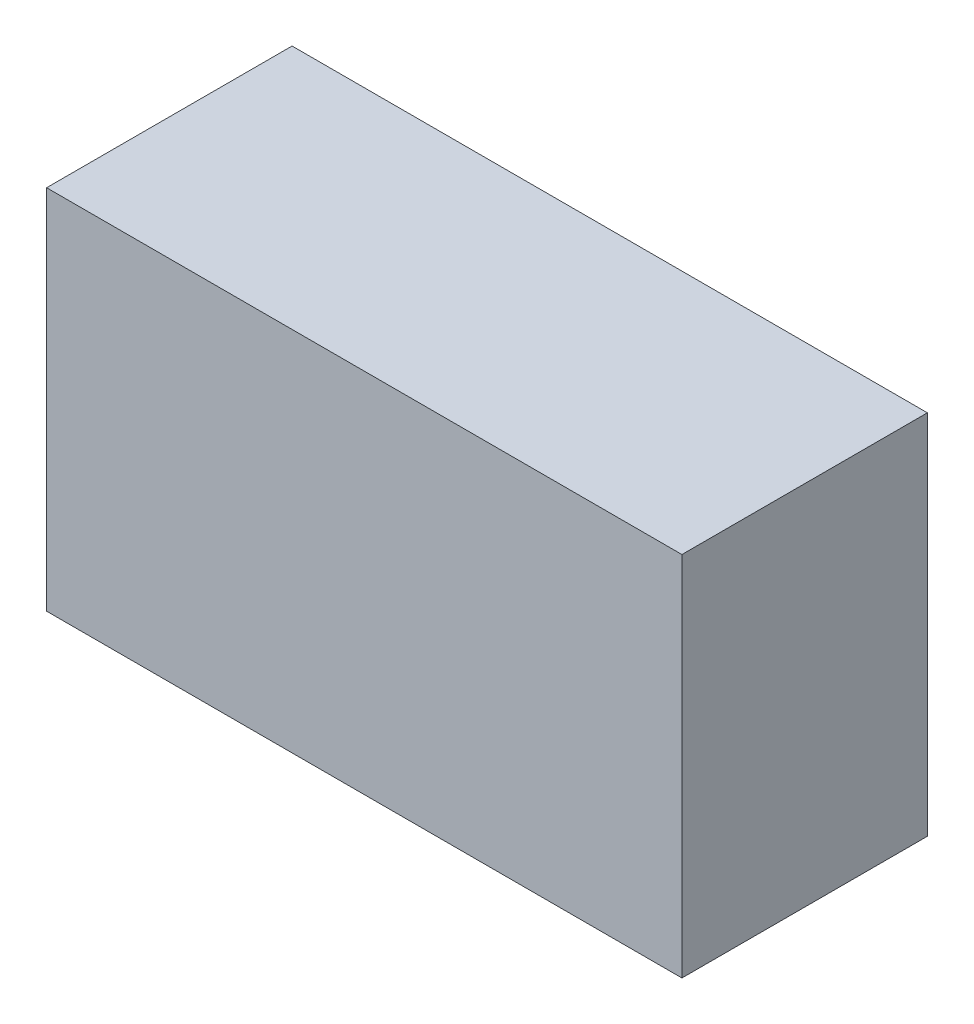
ISO-10303-21;
HEADER;
FILE_DESCRIPTION(('STEP AP214'),'2;1');
FILE_NAME('part.step','',(''),(''),'','','');
FILE_SCHEMA(('AUTOMOTIVE_DESIGN { 1 0 10303 214 1 1 1 1 }'));
ENDSEC;
DATA;
#1=APPLICATION_CONTEXT('core data for automotive mechanical design processes');
#2=APPLICATION_PROTOCOL_DEFINITION('international standard','automotive_design',2000,#1);
#3=PRODUCT_CONTEXT('',#1,'mechanical');
#4=PRODUCT('Part','Part','',(#3));
#5=PRODUCT_RELATED_PRODUCT_CATEGORY('part','',(#4));
#6=PRODUCT_DEFINITION_FORMATION('','',#4);
#7=PRODUCT_DEFINITION_CONTEXT('part definition',#1,'design');
#8=PRODUCT_DEFINITION('design','',#6,#7);
#9=PRODUCT_DEFINITION_SHAPE('','',#8);
#10=(LENGTH_UNIT() NAMED_UNIT(*) SI_UNIT(.MILLI.,.METRE.));
#11=(NAMED_UNIT(*) PLANE_ANGLE_UNIT() SI_UNIT($,.RADIAN.));
#12=(NAMED_UNIT(*) SI_UNIT($,.STERADIAN.) SOLID_ANGLE_UNIT());
#13=UNCERTAINTY_MEASURE_WITH_UNIT(LENGTH_MEASURE(1.E-05),#10,'distance_accuracy_value','');
#14=(GEOMETRIC_REPRESENTATION_CONTEXT(3) GLOBAL_UNCERTAINTY_ASSIGNED_CONTEXT((#13)) GLOBAL_UNIT_ASSIGNED_CONTEXT((#10,
#11,#12)) REPRESENTATION_CONTEXT('',''));
#15=CARTESIAN_POINT('',(0.,0.,0.));
#16=DIRECTION('',(0.,0.,1.));
#17=DIRECTION('',(1.,0.,0.));
#18=AXIS2_PLACEMENT_3D('',#15,#16,#17);
#19=CARTESIAN_POINT('',(-1.10000034,-0.635,0.85000084));
#20=DIRECTION('',(0.,0.,1.));
#21=DIRECTION('',(1.,0.,0.));
#22=AXIS2_PLACEMENT_3D('',#19,#20,#21);
#23=PLANE('',#22);
#24=DIRECTION('',(1.,0.,0.));
#25=VECTOR('',#24,1.);
#26=CARTESIAN_POINT('',(-1.10000034,0.635,0.85000084));
#27=LINE('',#26,#25);
#28=CARTESIAN_POINT('',(-1.10000034,0.635,0.85000084));
#29=VERTEX_POINT('',#28);
#30=CARTESIAN_POINT('',(1.10000034,0.635,0.85000084));
#31=VERTEX_POINT('',#30);
#32=EDGE_CURVE('E53',#29,#31,#27,.T.);
#33=ORIENTED_EDGE('',*,*,#32,.F.);
#34=DIRECTION('',(0.,1.,0.));
#35=VECTOR('',#34,1.);
#36=CARTESIAN_POINT('',(-1.10000034,-0.635,0.85000084));
#37=LINE('',#36,#35);
#38=CARTESIAN_POINT('',(-1.10000034,-0.635,0.85000084));
#39=VERTEX_POINT('',#38);
#40=EDGE_CURVE('E20',#29,#39,#37,.F.);
#41=ORIENTED_EDGE('',*,*,#40,.T.);
#42=DIRECTION('',(1.,0.,0.));
#43=VECTOR('',#42,1.);
#44=CARTESIAN_POINT('',(1.10000034,-0.635,0.85000084));
#45=LINE('',#44,#43);
#46=CARTESIAN_POINT('',(1.10000034,-0.635,0.85000084));
#47=VERTEX_POINT('',#46);
#48=EDGE_CURVE('E67',#47,#39,#45,.F.);
#49=ORIENTED_EDGE('',*,*,#48,.F.);
#50=DIRECTION('',(0.,1.,0.));
#51=VECTOR('',#50,1.);
#52=CARTESIAN_POINT('',(1.10000034,0.635,0.85000084));
#53=LINE('',#52,#51);
#54=EDGE_CURVE('E58',#31,#47,#53,.F.);
#55=ORIENTED_EDGE('',*,*,#54,.F.);
#56=EDGE_LOOP('',(#33,#41,#49,#55));
#57=FACE_BOUND('',#56,.T.);
#58=ADVANCED_FACE('F17',(#57),#23,.T.);
#59=CARTESIAN_POINT('',(1.10000034,-0.635,0.));
#60=DIRECTION('',(0.,-1.,0.));
#61=DIRECTION('',(0.,0.,-1.));
#62=AXIS2_PLACEMENT_3D('',#59,#60,#61);
#63=PLANE('',#62);
#64=DIRECTION('',(0.,0.,1.));
#65=VECTOR('',#64,1.);
#66=CARTESIAN_POINT('',(-1.10000034,-0.635,0.));
#67=LINE('',#66,#65);
#68=CARTESIAN_POINT('',(-1.10000034,-0.635,0.));
#69=VERTEX_POINT('',#68);
#70=EDGE_CURVE('E80',#69,#39,#67,.T.);
#71=ORIENTED_EDGE('',*,*,#70,.F.);
#72=DIRECTION('',(1.,0.,0.));
#73=VECTOR('',#72,1.);
#74=CARTESIAN_POINT('',(-1.10000034,-0.635,0.));
#75=LINE('',#74,#73);
#76=CARTESIAN_POINT('',(1.10000034,-0.635,0.));
#77=VERTEX_POINT('',#76);
#78=EDGE_CURVE('E75',#69,#77,#75,.T.);
#79=ORIENTED_EDGE('',*,*,#78,.T.);
#80=DIRECTION('',(0.,0.,-1.));
#81=VECTOR('',#80,1.);
#82=CARTESIAN_POINT('',(1.10000034,-0.635,0.));
#83=LINE('',#82,#81);
#84=EDGE_CURVE('E63',#47,#77,#83,.T.);
#85=ORIENTED_EDGE('',*,*,#84,.F.);
#86=ORIENTED_EDGE('',*,*,#48,.T.);
#87=EDGE_LOOP('',(#71,#79,#85,#86));
#88=FACE_BOUND('',#87,.T.);
#89=ADVANCED_FACE('F74',(#88),#63,.T.);
#90=CARTESIAN_POINT('',(1.10000034,0.635,0.));
#91=DIRECTION('',(1.,0.,0.));
#92=DIRECTION('',(0.,0.,-1.));
#93=AXIS2_PLACEMENT_3D('',#90,#91,#92);
#94=PLANE('',#93);
#95=ORIENTED_EDGE('',*,*,#84,.T.);
#96=DIRECTION('',(0.,1.,0.));
#97=VECTOR('',#96,1.);
#98=CARTESIAN_POINT('',(1.10000034,-0.635,0.));
#99=LINE('',#98,#97);
#100=CARTESIAN_POINT('',(1.10000034,0.635,0.));
#101=VERTEX_POINT('',#100);
#102=EDGE_CURVE('E84',#77,#101,#99,.T.);
#103=ORIENTED_EDGE('',*,*,#102,.T.);
#104=DIRECTION('',(0.,0.,1.));
#105=VECTOR('',#104,1.);
#106=CARTESIAN_POINT('',(1.10000034,0.635,0.));
#107=LINE('',#106,#105);
#108=EDGE_CURVE('E65',#31,#101,#107,.F.);
#109=ORIENTED_EDGE('',*,*,#108,.F.);
#110=ORIENTED_EDGE('',*,*,#54,.T.);
#111=EDGE_LOOP('',(#95,#103,#109,#110));
#112=FACE_BOUND('',#111,.T.);
#113=ADVANCED_FACE('F60',(#112),#94,.T.);
#114=CARTESIAN_POINT('',(-1.10000034,0.635,0.));
#115=DIRECTION('',(0.,1.,0.));
#116=DIRECTION('',(0.,0.,1.));
#117=AXIS2_PLACEMENT_3D('',#114,#115,#116);
#118=PLANE('',#117);
#119=ORIENTED_EDGE('',*,*,#108,.T.);
#120=DIRECTION('',(1.,0.,0.));
#121=VECTOR('',#120,1.);
#122=CARTESIAN_POINT('',(-1.10000034,0.635,0.));
#123=LINE('',#122,#121);
#124=CARTESIAN_POINT('',(-1.10000034,0.635,0.));
#125=VERTEX_POINT('',#124);
#126=EDGE_CURVE('E26',#101,#125,#123,.F.);
#127=ORIENTED_EDGE('',*,*,#126,.T.);
#128=DIRECTION('',(0.,0.,1.));
#129=VECTOR('',#128,1.);
#130=CARTESIAN_POINT('',(-1.10000034,0.635,0.));
#131=LINE('',#130,#129);
#132=EDGE_CURVE('E34',#29,#125,#131,.F.);
#133=ORIENTED_EDGE('',*,*,#132,.F.);
#134=ORIENTED_EDGE('',*,*,#32,.T.);
#135=EDGE_LOOP('',(#119,#127,#133,#134));
#136=FACE_BOUND('',#135,.T.);
#137=ADVANCED_FACE('F88',(#136),#118,.T.);
#138=CARTESIAN_POINT('',(-1.10000034,-0.635,0.));
#139=DIRECTION('',(-1.,0.,0.));
#140=DIRECTION('',(0.,0.,1.));
#141=AXIS2_PLACEMENT_3D('',#138,#139,#140);
#142=PLANE('',#141);
#143=ORIENTED_EDGE('',*,*,#132,.T.);
#144=DIRECTION('',(0.,1.,0.));
#145=VECTOR('',#144,1.);
#146=CARTESIAN_POINT('',(-1.10000034,-0.635,0.));
#147=LINE('',#146,#145);
#148=EDGE_CURVE('E11',#125,#69,#147,.F.);
#149=ORIENTED_EDGE('',*,*,#148,.T.);
#150=ORIENTED_EDGE('',*,*,#70,.T.);
#151=ORIENTED_EDGE('',*,*,#40,.F.);
#152=EDGE_LOOP('',(#143,#149,#150,#151));
#153=FACE_BOUND('',#152,.T.);
#154=ADVANCED_FACE('F91',(#153),#142,.T.);
#155=CARTESIAN_POINT('',(-1.10000034,-0.635,0.));
#156=DIRECTION('',(0.,0.,1.));
#157=DIRECTION('',(1.,0.,0.));
#158=AXIS2_PLACEMENT_3D('',#155,#156,#157);
#159=PLANE('',#158);
#160=ORIENTED_EDGE('',*,*,#126,.F.);
#161=ORIENTED_EDGE('',*,*,#102,.F.);
#162=ORIENTED_EDGE('',*,*,#78,.F.);
#163=ORIENTED_EDGE('',*,*,#148,.F.);
#164=EDGE_LOOP('',(#160,#161,#162,#163));
#165=FACE_BOUND('',#164,.T.);
#166=ADVANCED_FACE('F90',(#165),#159,.F.);
#167=CLOSED_SHELL('',(#58,#89,#113,#137,#154,#166));
#168=MANIFOLD_SOLID_BREP('B1',#167);
#169=ADVANCED_BREP_SHAPE_REPRESENTATION('',(#18,#168),#14);
#170=SHAPE_DEFINITION_REPRESENTATION(#9,#169);
ENDSEC;
END-ISO-10303-21;
